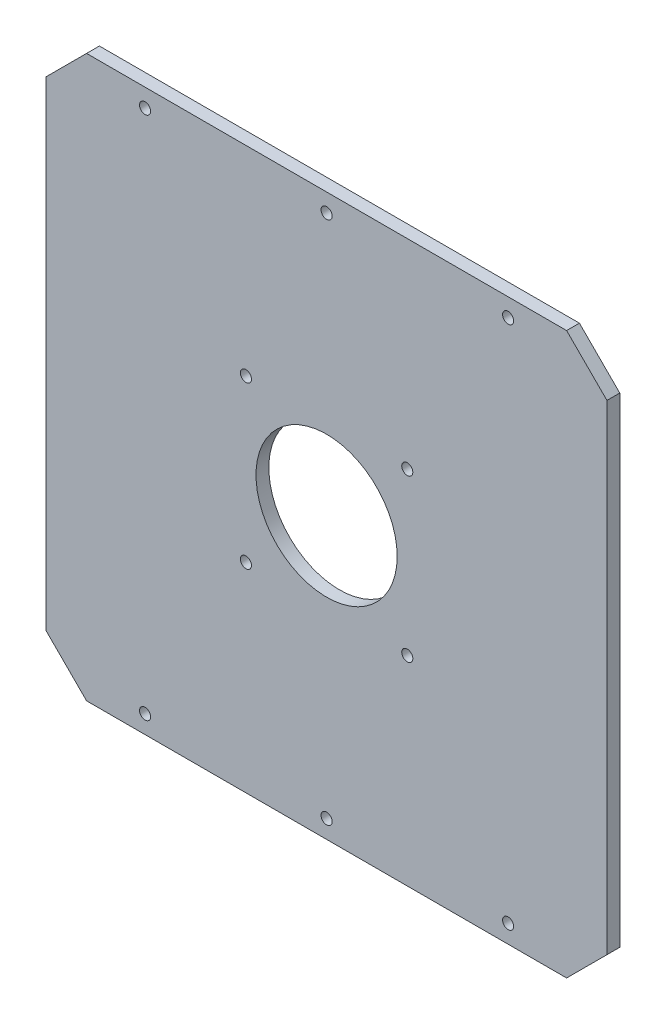
ISO-10303-21;
HEADER;
FILE_DESCRIPTION(('STEP AP214'),'2;1');
FILE_NAME('part.step','',(''),(''),'','','');
FILE_SCHEMA(('AUTOMOTIVE_DESIGN { 1 0 10303 214 1 1 1 1 }'));
ENDSEC;
DATA;
#1=APPLICATION_CONTEXT('core data for automotive mechanical design processes');
#2=APPLICATION_PROTOCOL_DEFINITION('international standard','automotive_design',2000,#1);
#3=PRODUCT_CONTEXT('',#1,'mechanical');
#4=PRODUCT('Part','Part','',(#3));
#5=PRODUCT_RELATED_PRODUCT_CATEGORY('part','',(#4));
#6=PRODUCT_DEFINITION_FORMATION('','',#4);
#7=PRODUCT_DEFINITION_CONTEXT('part definition',#1,'design');
#8=PRODUCT_DEFINITION('design','',#6,#7);
#9=PRODUCT_DEFINITION_SHAPE('','',#8);
#10=(LENGTH_UNIT() NAMED_UNIT(*) SI_UNIT(.MILLI.,.METRE.));
#11=(NAMED_UNIT(*) PLANE_ANGLE_UNIT() SI_UNIT($,.RADIAN.));
#12=(NAMED_UNIT(*) SI_UNIT($,.STERADIAN.) SOLID_ANGLE_UNIT());
#13=UNCERTAINTY_MEASURE_WITH_UNIT(LENGTH_MEASURE(1.E-05),#10,'distance_accuracy_value','');
#14=(GEOMETRIC_REPRESENTATION_CONTEXT(3) GLOBAL_UNCERTAINTY_ASSIGNED_CONTEXT((#13)) GLOBAL_UNIT_ASSIGNED_CONTEXT((#10,
#11,#12)) REPRESENTATION_CONTEXT('',''));
#15=CARTESIAN_POINT('',(0.,0.,0.));
#16=DIRECTION('',(0.,0.,1.));
#17=DIRECTION('',(1.,0.,0.));
#18=AXIS2_PLACEMENT_3D('',#15,#16,#17);
#19=CARTESIAN_POINT('',(-139.,-139.,6.35));
#20=DIRECTION('',(1.,0.,0.));
#21=DIRECTION('',(0.,0.,-1.));
#22=AXIS2_PLACEMENT_3D('',#19,#20,#21);
#23=PLANE('',#22);
#24=DIRECTION('',(0.,-1.,0.));
#25=VECTOR('',#24,1.);
#26=CARTESIAN_POINT('',(-139.,-139.,6.35));
#27=LINE('',#26,#25);
#28=CARTESIAN_POINT('',(-139.,119.,6.35));
#29=VERTEX_POINT('',#28);
#30=CARTESIAN_POINT('',(-139.,-119.,6.35));
#31=VERTEX_POINT('',#30);
#32=EDGE_CURVE('E130',#29,#31,#27,.T.);
#33=ORIENTED_EDGE('',*,*,#32,.F.);
#34=DIRECTION('',(0.,0.,-1.));
#35=VECTOR('',#34,1.);
#36=CARTESIAN_POINT('',(-139.,119.,6.35));
#37=LINE('',#36,#35);
#38=CARTESIAN_POINT('',(-139.,119.,0.));
#39=VERTEX_POINT('',#38);
#40=EDGE_CURVE('E11',#29,#39,#37,.T.);
#41=ORIENTED_EDGE('',*,*,#40,.T.);
#42=DIRECTION('',(0.,-1.,0.));
#43=VECTOR('',#42,1.);
#44=CARTESIAN_POINT('',(-139.,-139.,0.));
#45=LINE('',#44,#43);
#46=CARTESIAN_POINT('',(-139.,-119.,0.));
#47=VERTEX_POINT('',#46);
#48=EDGE_CURVE('E132',#39,#47,#45,.T.);
#49=ORIENTED_EDGE('',*,*,#48,.T.);
#50=DIRECTION('',(0.,0.,1.));
#51=VECTOR('',#50,1.);
#52=CARTESIAN_POINT('',(-139.,-119.,6.35));
#53=LINE('',#52,#51);
#54=EDGE_CURVE('E42',#47,#31,#53,.T.);
#55=ORIENTED_EDGE('',*,*,#54,.T.);
#56=EDGE_LOOP('',(#33,#41,#49,#55));
#57=FACE_BOUND('',#56,.T.);
#58=ADVANCED_FACE('F33',(#57),#23,.F.);
#59=CARTESIAN_POINT('',(139.,-139.,6.35));
#60=DIRECTION('',(0.,1.,0.));
#61=DIRECTION('',(0.,0.,1.));
#62=AXIS2_PLACEMENT_3D('',#59,#60,#61);
#63=PLANE('',#62);
#64=DIRECTION('',(1.,0.,0.));
#65=VECTOR('',#64,1.);
#66=CARTESIAN_POINT('',(139.,-139.,0.));
#67=LINE('',#66,#65);
#68=CARTESIAN_POINT('',(-119.,-139.,0.));
#69=VERTEX_POINT('',#68);
#70=CARTESIAN_POINT('',(119.,-139.,0.));
#71=VERTEX_POINT('',#70);
#72=EDGE_CURVE('E128',#69,#71,#67,.T.);
#73=ORIENTED_EDGE('',*,*,#72,.T.);
#74=DIRECTION('',(0.,0.,1.));
#75=VECTOR('',#74,1.);
#76=CARTESIAN_POINT('',(119.,-139.,6.35));
#77=LINE('',#76,#75);
#78=CARTESIAN_POINT('',(119.,-139.,6.35));
#79=VERTEX_POINT('',#78);
#80=EDGE_CURVE('E107',#71,#79,#77,.T.);
#81=ORIENTED_EDGE('',*,*,#80,.T.);
#82=DIRECTION('',(1.,0.,0.));
#83=VECTOR('',#82,1.);
#84=CARTESIAN_POINT('',(139.,-139.,6.35));
#85=LINE('',#84,#83);
#86=CARTESIAN_POINT('',(-119.,-139.,6.35));
#87=VERTEX_POINT('',#86);
#88=EDGE_CURVE('E225',#87,#79,#85,.T.);
#89=ORIENTED_EDGE('',*,*,#88,.F.);
#90=DIRECTION('',(0.,0.,-1.));
#91=VECTOR('',#90,1.);
#92=CARTESIAN_POINT('',(-119.,-139.,6.35));
#93=LINE('',#92,#91);
#94=EDGE_CURVE('E112',#87,#69,#93,.T.);
#95=ORIENTED_EDGE('',*,*,#94,.T.);
#96=EDGE_LOOP('',(#73,#81,#89,#95));
#97=FACE_BOUND('',#96,.T.);
#98=ADVANCED_FACE('F241',(#97),#63,.F.);
#99=CARTESIAN_POINT('',(139.,-139.,6.35));
#100=DIRECTION('',(-1.,0.,0.));
#101=DIRECTION('',(0.,0.,1.));
#102=AXIS2_PLACEMENT_3D('',#99,#100,#101);
#103=PLANE('',#102);
#104=DIRECTION('',(0.,1.,0.));
#105=VECTOR('',#104,1.);
#106=CARTESIAN_POINT('',(139.,-139.,6.35));
#107=LINE('',#106,#105);
#108=CARTESIAN_POINT('',(139.,-119.,6.35));
#109=VERTEX_POINT('',#108);
#110=CARTESIAN_POINT('',(139.,119.,6.35));
#111=VERTEX_POINT('',#110);
#112=EDGE_CURVE('E121',#109,#111,#107,.T.);
#113=ORIENTED_EDGE('',*,*,#112,.F.);
#114=DIRECTION('',(0.,0.,-1.));
#115=VECTOR('',#114,1.);
#116=CARTESIAN_POINT('',(139.,-119.,6.35));
#117=LINE('',#116,#115);
#118=CARTESIAN_POINT('',(139.,-119.,0.));
#119=VERTEX_POINT('',#118);
#120=EDGE_CURVE('E106',#109,#119,#117,.T.);
#121=ORIENTED_EDGE('',*,*,#120,.T.);
#122=DIRECTION('',(0.,1.,0.));
#123=VECTOR('',#122,1.);
#124=CARTESIAN_POINT('',(139.,-139.,0.));
#125=LINE('',#124,#123);
#126=CARTESIAN_POINT('',(139.,119.,0.));
#127=VERTEX_POINT('',#126);
#128=EDGE_CURVE('E119',#119,#127,#125,.T.);
#129=ORIENTED_EDGE('',*,*,#128,.T.);
#130=DIRECTION('',(0.,0.,1.));
#131=VECTOR('',#130,1.);
#132=CARTESIAN_POINT('',(139.,119.,6.35));
#133=LINE('',#132,#131);
#134=EDGE_CURVE('E123',#127,#111,#133,.T.);
#135=ORIENTED_EDGE('',*,*,#134,.T.);
#136=EDGE_LOOP('',(#113,#121,#129,#135));
#137=FACE_BOUND('',#136,.T.);
#138=ADVANCED_FACE('F118',(#137),#103,.F.);
#139=CARTESIAN_POINT('',(139.,139.,6.35));
#140=DIRECTION('',(0.,-1.,0.));
#141=DIRECTION('',(0.,0.,-1.));
#142=AXIS2_PLACEMENT_3D('',#139,#140,#141);
#143=PLANE('',#142);
#144=DIRECTION('',(-1.,0.,0.));
#145=VECTOR('',#144,1.);
#146=CARTESIAN_POINT('',(139.,139.,6.35));
#147=LINE('',#146,#145);
#148=CARTESIAN_POINT('',(119.,139.,6.35));
#149=VERTEX_POINT('',#148);
#150=CARTESIAN_POINT('',(-119.,139.,6.35));
#151=VERTEX_POINT('',#150);
#152=EDGE_CURVE('E136',#149,#151,#147,.T.);
#153=ORIENTED_EDGE('',*,*,#152,.F.);
#154=DIRECTION('',(0.,0.,-1.));
#155=VECTOR('',#154,1.);
#156=CARTESIAN_POINT('',(119.,139.,6.35));
#157=LINE('',#156,#155);
#158=CARTESIAN_POINT('',(119.,139.,0.));
#159=VERTEX_POINT('',#158);
#160=EDGE_CURVE('E153',#149,#159,#157,.T.);
#161=ORIENTED_EDGE('',*,*,#160,.T.);
#162=DIRECTION('',(-1.,0.,0.));
#163=VECTOR('',#162,1.);
#164=CARTESIAN_POINT('',(139.,139.,0.));
#165=LINE('',#164,#163);
#166=CARTESIAN_POINT('',(-119.,139.,0.));
#167=VERTEX_POINT('',#166);
#168=EDGE_CURVE('E127',#159,#167,#165,.T.);
#169=ORIENTED_EDGE('',*,*,#168,.T.);
#170=DIRECTION('',(0.,0.,1.));
#171=VECTOR('',#170,1.);
#172=CARTESIAN_POINT('',(-119.,139.,6.35));
#173=LINE('',#172,#171);
#174=EDGE_CURVE('E50',#167,#151,#173,.T.);
#175=ORIENTED_EDGE('',*,*,#174,.T.);
#176=EDGE_LOOP('',(#153,#161,#169,#175));
#177=FACE_BOUND('',#176,.T.);
#178=ADVANCED_FACE('F248',(#177),#143,.F.);
#179=CARTESIAN_POINT('',(0.,0.,6.35));
#180=DIRECTION('',(0.,0.,1.));
#181=DIRECTION('',(1.,0.,0.));
#182=AXIS2_PLACEMENT_3D('',#179,#180,#181);
#183=PLANE('',#182);
#184=CARTESIAN_POINT('',(-90.,-130.,6.35));
#185=DIRECTION('',(0.,0.,1.));
#186=DIRECTION('',(-1.,0.,0.));
#187=AXIS2_PLACEMENT_3D('',#184,#185,#186);
#188=CIRCLE('',#187,2.75000000000001);
#189=CARTESIAN_POINT('',(-92.75,-130.,6.35));
#190=VERTEX_POINT('',#189);
#191=EDGE_CURVE('E185',#190,#190,#188,.T.);
#192=ORIENTED_EDGE('',*,*,#191,.F.);
#193=EDGE_LOOP('',(#192));
#194=FACE_BOUND('',#193,.T.);
#195=CARTESIAN_POINT('',(0.,-130.,6.35));
#196=DIRECTION('',(0.,0.,1.));
#197=DIRECTION('',(-1.,0.,0.));
#198=AXIS2_PLACEMENT_3D('',#195,#196,#197);
#199=CIRCLE('',#198,2.75);
#200=CARTESIAN_POINT('',(-2.74999999999996,-130.,6.35));
#201=VERTEX_POINT('',#200);
#202=EDGE_CURVE('E175',#201,#201,#199,.T.);
#203=ORIENTED_EDGE('',*,*,#202,.F.);
#204=EDGE_LOOP('',(#203));
#205=FACE_BOUND('',#204,.T.);
#206=CARTESIAN_POINT('',(90.0000000000001,-130.,6.35));
#207=DIRECTION('',(0.,0.,1.));
#208=DIRECTION('',(1.,0.,0.));
#209=AXIS2_PLACEMENT_3D('',#206,#207,#208);
#210=CIRCLE('',#209,2.75000000000001);
#211=CARTESIAN_POINT('',(92.7500000000001,-130.,6.35));
#212=VERTEX_POINT('',#211);
#213=EDGE_CURVE('E172',#212,#212,#210,.T.);
#214=ORIENTED_EDGE('',*,*,#213,.F.);
#215=EDGE_LOOP('',(#214));
#216=FACE_BOUND('',#215,.T.);
#217=CARTESIAN_POINT('',(90.,130.,6.35));
#218=DIRECTION('',(0.,0.,1.));
#219=DIRECTION('',(-1.,0.,0.));
#220=AXIS2_PLACEMENT_3D('',#217,#218,#219);
#221=CIRCLE('',#220,2.75000000000001);
#222=CARTESIAN_POINT('',(87.25,130.,6.35));
#223=VERTEX_POINT('',#222);
#224=EDGE_CURVE('E169',#223,#223,#221,.T.);
#225=ORIENTED_EDGE('',*,*,#224,.F.);
#226=EDGE_LOOP('',(#225));
#227=FACE_BOUND('',#226,.T.);
#228=CARTESIAN_POINT('',(0.,130.,6.35));
#229=DIRECTION('',(0.,0.,1.));
#230=DIRECTION('',(1.,0.,0.));
#231=AXIS2_PLACEMENT_3D('',#228,#229,#230);
#232=CIRCLE('',#231,2.75);
#233=CARTESIAN_POINT('',(2.75000000000002,130.,6.35));
#234=VERTEX_POINT('',#233);
#235=EDGE_CURVE('E165',#234,#234,#232,.T.);
#236=ORIENTED_EDGE('',*,*,#235,.F.);
#237=EDGE_LOOP('',(#236));
#238=FACE_BOUND('',#237,.T.);
#239=CARTESIAN_POINT('',(-90.,130.,6.35));
#240=DIRECTION('',(0.,0.,1.));
#241=DIRECTION('',(1.,0.,0.));
#242=AXIS2_PLACEMENT_3D('',#239,#240,#241);
#243=CIRCLE('',#242,2.75000000000001);
#244=CARTESIAN_POINT('',(-87.25,130.,6.35));
#245=VERTEX_POINT('',#244);
#246=EDGE_CURVE('E161',#245,#245,#243,.T.);
#247=ORIENTED_EDGE('',*,*,#246,.F.);
#248=EDGE_LOOP('',(#247));
#249=FACE_BOUND('',#248,.T.);
#250=CARTESIAN_POINT('',(-40.,-40.,6.35));
#251=DIRECTION('',(0.,0.,1.));
#252=DIRECTION('',(-1.,0.,0.));
#253=AXIS2_PLACEMENT_3D('',#250,#251,#252);
#254=CIRCLE('',#253,2.75);
#255=CARTESIAN_POINT('',(-42.75,-40.,6.35));
#256=VERTEX_POINT('',#255);
#257=EDGE_CURVE('E160',#256,#256,#254,.T.);
#258=ORIENTED_EDGE('',*,*,#257,.F.);
#259=EDGE_LOOP('',(#258));
#260=FACE_BOUND('',#259,.T.);
#261=CARTESIAN_POINT('',(40.,-40.,6.35));
#262=DIRECTION('',(0.,0.,1.));
#263=DIRECTION('',(1.,0.,0.));
#264=AXIS2_PLACEMENT_3D('',#261,#262,#263);
#265=CIRCLE('',#264,2.75);
#266=CARTESIAN_POINT('',(42.75,-40.,6.35));
#267=VERTEX_POINT('',#266);
#268=EDGE_CURVE('E197',#267,#267,#265,.T.);
#269=ORIENTED_EDGE('',*,*,#268,.F.);
#270=EDGE_LOOP('',(#269));
#271=FACE_BOUND('',#270,.T.);
#272=CARTESIAN_POINT('',(40.,40.,6.35));
#273=DIRECTION('',(0.,0.,1.));
#274=DIRECTION('',(-1.,0.,0.));
#275=AXIS2_PLACEMENT_3D('',#272,#273,#274);
#276=CIRCLE('',#275,2.75);
#277=CARTESIAN_POINT('',(37.25,40.,6.35));
#278=VERTEX_POINT('',#277);
#279=EDGE_CURVE('E203',#278,#278,#276,.T.);
#280=ORIENTED_EDGE('',*,*,#279,.F.);
#281=EDGE_LOOP('',(#280));
#282=FACE_BOUND('',#281,.T.);
#283=CARTESIAN_POINT('',(-40.,40.,6.35));
#284=DIRECTION('',(0.,0.,1.));
#285=DIRECTION('',(1.,0.,0.));
#286=AXIS2_PLACEMENT_3D('',#283,#284,#285);
#287=CIRCLE('',#286,2.75);
#288=CARTESIAN_POINT('',(-37.25,40.,6.35));
#289=VERTEX_POINT('',#288);
#290=EDGE_CURVE('E209',#289,#289,#287,.T.);
#291=ORIENTED_EDGE('',*,*,#290,.F.);
#292=EDGE_LOOP('',(#291));
#293=FACE_BOUND('',#292,.T.);
#294=CARTESIAN_POINT('',(0.,0.,6.35));
#295=DIRECTION('',(0.,0.,1.));
#296=DIRECTION('',(1.,0.,0.));
#297=AXIS2_PLACEMENT_3D('',#294,#295,#296);
#298=CIRCLE('',#297,35.);
#299=CARTESIAN_POINT('',(35.,0.,6.35));
#300=VERTEX_POINT('',#299);
#301=EDGE_CURVE('E215',#300,#300,#298,.T.);
#302=ORIENTED_EDGE('',*,*,#301,.F.);
#303=EDGE_LOOP('',(#302));
#304=FACE_BOUND('',#303,.T.);
#305=ORIENTED_EDGE('',*,*,#88,.T.);
#306=DIRECTION('',(-0.70710678118655,-0.707106781186546,0.));
#307=VECTOR('',#306,1.);
#308=CARTESIAN_POINT('',(129.,-129.,6.35));
#309=LINE('',#308,#307);
#310=EDGE_CURVE('E150',#79,#109,#309,.F.);
#311=ORIENTED_EDGE('',*,*,#310,.T.);
#312=ORIENTED_EDGE('',*,*,#112,.T.);
#313=DIRECTION('',(0.707106781186546,-0.70710678118655,0.));
#314=VECTOR('',#313,1.);
#315=CARTESIAN_POINT('',(129.,129.,6.35));
#316=LINE('',#315,#314);
#317=EDGE_CURVE('E57',#111,#149,#316,.F.);
#318=ORIENTED_EDGE('',*,*,#317,.T.);
#319=ORIENTED_EDGE('',*,*,#152,.T.);
#320=DIRECTION('',(0.70710678118655,0.707106781186546,0.));
#321=VECTOR('',#320,1.);
#322=CARTESIAN_POINT('',(-129.,129.,6.35));
#323=LINE('',#322,#321);
#324=EDGE_CURVE('E147',#151,#29,#323,.F.);
#325=ORIENTED_EDGE('',*,*,#324,.T.);
#326=ORIENTED_EDGE('',*,*,#32,.T.);
#327=DIRECTION('',(-0.707106781186546,0.70710678118655,0.));
#328=VECTOR('',#327,1.);
#329=CARTESIAN_POINT('',(-129.,-129.,6.35));
#330=LINE('',#329,#328);
#331=EDGE_CURVE('E145',#31,#87,#330,.F.);
#332=ORIENTED_EDGE('',*,*,#331,.T.);
#333=EDGE_LOOP('',(#305,#311,#312,#318,#319,#325,#326,#332));
#334=FACE_BOUND('',#333,.T.);
#335=ADVANCED_FACE('F239',(#194,#205,#216,#227,#238,#249,#260,#271,#282,#293,#304,#334),#183,.T.);
#336=CARTESIAN_POINT('',(0.,0.,0.));
#337=DIRECTION('',(0.,0.,1.));
#338=DIRECTION('',(1.,0.,0.));
#339=AXIS2_PLACEMENT_3D('',#336,#337,#338);
#340=PLANE('',#339);
#341=CARTESIAN_POINT('',(-90.,-130.,0.));
#342=DIRECTION('',(0.,0.,1.));
#343=DIRECTION('',(1.,0.,0.));
#344=AXIS2_PLACEMENT_3D('',#341,#342,#343);
#345=CIRCLE('',#344,2.75000000000001);
#346=CARTESIAN_POINT('',(-87.25,-130.,0.));
#347=VERTEX_POINT('',#346);
#348=EDGE_CURVE('E37',#347,#347,#345,.T.);
#349=ORIENTED_EDGE('',*,*,#348,.T.);
#350=EDGE_LOOP('',(#349));
#351=FACE_BOUND('',#350,.T.);
#352=CARTESIAN_POINT('',(0.,-130.,0.));
#353=DIRECTION('',(0.,0.,1.));
#354=DIRECTION('',(1.,0.,0.));
#355=AXIS2_PLACEMENT_3D('',#352,#353,#354);
#356=CIRCLE('',#355,2.75);
#357=CARTESIAN_POINT('',(2.75000000000005,-130.,0.));
#358=VERTEX_POINT('',#357);
#359=EDGE_CURVE('E173',#358,#358,#356,.T.);
#360=ORIENTED_EDGE('',*,*,#359,.T.);
#361=EDGE_LOOP('',(#360));
#362=FACE_BOUND('',#361,.T.);
#363=CARTESIAN_POINT('',(90.0000000000001,-130.,0.));
#364=DIRECTION('',(0.,0.,1.));
#365=DIRECTION('',(1.,0.,0.));
#366=AXIS2_PLACEMENT_3D('',#363,#364,#365);
#367=CIRCLE('',#366,2.75000000000001);
#368=CARTESIAN_POINT('',(92.7500000000001,-130.,0.));
#369=VERTEX_POINT('',#368);
#370=EDGE_CURVE('E170',#369,#369,#367,.T.);
#371=ORIENTED_EDGE('',*,*,#370,.T.);
#372=EDGE_LOOP('',(#371));
#373=FACE_BOUND('',#372,.T.);
#374=CARTESIAN_POINT('',(90.,130.,0.));
#375=DIRECTION('',(0.,0.,1.));
#376=DIRECTION('',(1.,0.,0.));
#377=AXIS2_PLACEMENT_3D('',#374,#375,#376);
#378=CIRCLE('',#377,2.75000000000001);
#379=CARTESIAN_POINT('',(92.75,130.,0.));
#380=VERTEX_POINT('',#379);
#381=EDGE_CURVE('E166',#380,#380,#378,.T.);
#382=ORIENTED_EDGE('',*,*,#381,.T.);
#383=EDGE_LOOP('',(#382));
#384=FACE_BOUND('',#383,.T.);
#385=CARTESIAN_POINT('',(0.,130.,0.));
#386=DIRECTION('',(0.,0.,1.));
#387=DIRECTION('',(1.,0.,0.));
#388=AXIS2_PLACEMENT_3D('',#385,#386,#387);
#389=CIRCLE('',#388,2.75);
#390=CARTESIAN_POINT('',(2.75000000000002,130.,0.));
#391=VERTEX_POINT('',#390);
#392=EDGE_CURVE('E162',#391,#391,#389,.T.);
#393=ORIENTED_EDGE('',*,*,#392,.T.);
#394=EDGE_LOOP('',(#393));
#395=FACE_BOUND('',#394,.T.);
#396=CARTESIAN_POINT('',(-90.,130.,0.));
#397=DIRECTION('',(0.,0.,1.));
#398=DIRECTION('',(1.,0.,0.));
#399=AXIS2_PLACEMENT_3D('',#396,#397,#398);
#400=CIRCLE('',#399,2.75000000000001);
#401=CARTESIAN_POINT('',(-87.25,130.,0.));
#402=VERTEX_POINT('',#401);
#403=EDGE_CURVE('E157',#402,#402,#400,.T.);
#404=ORIENTED_EDGE('',*,*,#403,.T.);
#405=EDGE_LOOP('',(#404));
#406=FACE_BOUND('',#405,.T.);
#407=CARTESIAN_POINT('',(-40.,-40.,0.));
#408=DIRECTION('',(0.,0.,1.));
#409=DIRECTION('',(-1.,0.,0.));
#410=AXIS2_PLACEMENT_3D('',#407,#408,#409);
#411=CIRCLE('',#410,2.75);
#412=CARTESIAN_POINT('',(-42.75,-40.,0.));
#413=VERTEX_POINT('',#412);
#414=EDGE_CURVE('E194',#413,#413,#411,.T.);
#415=ORIENTED_EDGE('',*,*,#414,.T.);
#416=EDGE_LOOP('',(#415));
#417=FACE_BOUND('',#416,.T.);
#418=CARTESIAN_POINT('',(40.,-40.,0.));
#419=DIRECTION('',(0.,0.,1.));
#420=DIRECTION('',(1.,0.,0.));
#421=AXIS2_PLACEMENT_3D('',#418,#419,#420);
#422=CIRCLE('',#421,2.75);
#423=CARTESIAN_POINT('',(42.75,-40.,0.));
#424=VERTEX_POINT('',#423);
#425=EDGE_CURVE('E200',#424,#424,#422,.T.);
#426=ORIENTED_EDGE('',*,*,#425,.T.);
#427=EDGE_LOOP('',(#426));
#428=FACE_BOUND('',#427,.T.);
#429=CARTESIAN_POINT('',(40.,40.,0.));
#430=DIRECTION('',(0.,0.,1.));
#431=DIRECTION('',(-1.,0.,0.));
#432=AXIS2_PLACEMENT_3D('',#429,#430,#431);
#433=CIRCLE('',#432,2.75);
#434=CARTESIAN_POINT('',(37.25,40.,0.));
#435=VERTEX_POINT('',#434);
#436=EDGE_CURVE('E206',#435,#435,#433,.T.);
#437=ORIENTED_EDGE('',*,*,#436,.T.);
#438=EDGE_LOOP('',(#437));
#439=FACE_BOUND('',#438,.T.);
#440=CARTESIAN_POINT('',(-40.,40.,0.));
#441=DIRECTION('',(0.,0.,1.));
#442=DIRECTION('',(1.,0.,0.));
#443=AXIS2_PLACEMENT_3D('',#440,#441,#442);
#444=CIRCLE('',#443,2.75);
#445=CARTESIAN_POINT('',(-37.25,40.,0.));
#446=VERTEX_POINT('',#445);
#447=EDGE_CURVE('E212',#446,#446,#444,.T.);
#448=ORIENTED_EDGE('',*,*,#447,.T.);
#449=EDGE_LOOP('',(#448));
#450=FACE_BOUND('',#449,.T.);
#451=CARTESIAN_POINT('',(0.,0.,0.));
#452=DIRECTION('',(0.,0.,1.));
#453=DIRECTION('',(1.,0.,0.));
#454=AXIS2_PLACEMENT_3D('',#451,#452,#453);
#455=CIRCLE('',#454,35.);
#456=CARTESIAN_POINT('',(35.,0.,0.));
#457=VERTEX_POINT('',#456);
#458=EDGE_CURVE('E218',#457,#457,#455,.T.);
#459=ORIENTED_EDGE('',*,*,#458,.T.);
#460=EDGE_LOOP('',(#459));
#461=FACE_BOUND('',#460,.T.);
#462=ORIENTED_EDGE('',*,*,#128,.F.);
#463=DIRECTION('',(0.70710678118655,0.707106781186546,0.));
#464=VECTOR('',#463,1.);
#465=CARTESIAN_POINT('',(139.,-119.,0.));
#466=LINE('',#465,#464);
#467=EDGE_CURVE('E102',#119,#71,#466,.F.);
#468=ORIENTED_EDGE('',*,*,#467,.T.);
#469=ORIENTED_EDGE('',*,*,#72,.F.);
#470=DIRECTION('',(0.707106781186546,-0.70710678118655,0.));
#471=VECTOR('',#470,1.);
#472=CARTESIAN_POINT('',(-119.,-139.,0.));
#473=LINE('',#472,#471);
#474=EDGE_CURVE('E122',#69,#47,#473,.F.);
#475=ORIENTED_EDGE('',*,*,#474,.T.);
#476=ORIENTED_EDGE('',*,*,#48,.F.);
#477=DIRECTION('',(-0.70710678118655,-0.707106781186546,0.));
#478=VECTOR('',#477,1.);
#479=CARTESIAN_POINT('',(-139.,119.,0.));
#480=LINE('',#479,#478);
#481=EDGE_CURVE('E139',#39,#167,#480,.F.);
#482=ORIENTED_EDGE('',*,*,#481,.T.);
#483=ORIENTED_EDGE('',*,*,#168,.F.);
#484=DIRECTION('',(-0.707106781186546,0.70710678118655,0.));
#485=VECTOR('',#484,1.);
#486=CARTESIAN_POINT('',(119.,139.,0.));
#487=LINE('',#486,#485);
#488=EDGE_CURVE('E113',#159,#127,#487,.F.);
#489=ORIENTED_EDGE('',*,*,#488,.T.);
#490=EDGE_LOOP('',(#462,#468,#469,#475,#476,#482,#483,#489));
#491=FACE_BOUND('',#490,.T.);
#492=ADVANCED_FACE('F125',(#351,#362,#373,#384,#395,#406,#417,#428,#439,#450,#461,#491),#340,.F.);
#493=CARTESIAN_POINT('',(0.,0.,0.));
#494=DIRECTION('',(0.,0.,1.));
#495=DIRECTION('',(1.,0.,0.));
#496=AXIS2_PLACEMENT_3D('',#493,#494,#495);
#497=CYLINDRICAL_SURFACE('',#496,35.);
#498=ORIENTED_EDGE('',*,*,#458,.F.);
#499=EDGE_LOOP('',(#498));
#500=FACE_BOUND('',#499,.T.);
#501=ORIENTED_EDGE('',*,*,#301,.T.);
#502=EDGE_LOOP('',(#501));
#503=FACE_BOUND('',#502,.T.);
#504=ADVANCED_FACE('F276',(#500,#503),#497,.F.);
#505=CARTESIAN_POINT('',(-40.,40.,0.));
#506=DIRECTION('',(0.,0.,1.));
#507=DIRECTION('',(1.,0.,0.));
#508=AXIS2_PLACEMENT_3D('',#505,#506,#507);
#509=CYLINDRICAL_SURFACE('',#508,2.75);
#510=ORIENTED_EDGE('',*,*,#447,.F.);
#511=EDGE_LOOP('',(#510));
#512=FACE_BOUND('',#511,.T.);
#513=ORIENTED_EDGE('',*,*,#290,.T.);
#514=EDGE_LOOP('',(#513));
#515=FACE_BOUND('',#514,.T.);
#516=ADVANCED_FACE('F281',(#512,#515),#509,.F.);
#517=CARTESIAN_POINT('',(40.,40.,0.));
#518=DIRECTION('',(0.,0.,1.));
#519=DIRECTION('',(1.,0.,0.));
#520=AXIS2_PLACEMENT_3D('',#517,#518,#519);
#521=CYLINDRICAL_SURFACE('',#520,2.75);
#522=ORIENTED_EDGE('',*,*,#436,.F.);
#523=EDGE_LOOP('',(#522));
#524=FACE_BOUND('',#523,.T.);
#525=ORIENTED_EDGE('',*,*,#279,.T.);
#526=EDGE_LOOP('',(#525));
#527=FACE_BOUND('',#526,.T.);
#528=ADVANCED_FACE('F285',(#524,#527),#521,.F.);
#529=CARTESIAN_POINT('',(40.,-40.,0.));
#530=DIRECTION('',(0.,0.,1.));
#531=DIRECTION('',(1.,0.,0.));
#532=AXIS2_PLACEMENT_3D('',#529,#530,#531);
#533=CYLINDRICAL_SURFACE('',#532,2.75);
#534=ORIENTED_EDGE('',*,*,#425,.F.);
#535=EDGE_LOOP('',(#534));
#536=FACE_BOUND('',#535,.T.);
#537=ORIENTED_EDGE('',*,*,#268,.T.);
#538=EDGE_LOOP('',(#537));
#539=FACE_BOUND('',#538,.T.);
#540=ADVANCED_FACE('F289',(#536,#539),#533,.F.);
#541=CARTESIAN_POINT('',(-40.,-40.,0.));
#542=DIRECTION('',(0.,0.,1.));
#543=DIRECTION('',(1.,0.,0.));
#544=AXIS2_PLACEMENT_3D('',#541,#542,#543);
#545=CYLINDRICAL_SURFACE('',#544,2.75);
#546=ORIENTED_EDGE('',*,*,#414,.F.);
#547=EDGE_LOOP('',(#546));
#548=FACE_BOUND('',#547,.T.);
#549=ORIENTED_EDGE('',*,*,#257,.T.);
#550=EDGE_LOOP('',(#549));
#551=FACE_BOUND('',#550,.T.);
#552=ADVANCED_FACE('F256',(#548,#551),#545,.F.);
#553=CARTESIAN_POINT('',(139.,-119.,6.35));
#554=DIRECTION('',(-0.707106781186545,0.707106781186549,0.));
#555=DIRECTION('',(0.,0.,-1.));
#556=AXIS2_PLACEMENT_3D('',#553,#554,#555);
#557=PLANE('',#556);
#558=ORIENTED_EDGE('',*,*,#310,.F.);
#559=ORIENTED_EDGE('',*,*,#80,.F.);
#560=ORIENTED_EDGE('',*,*,#467,.F.);
#561=ORIENTED_EDGE('',*,*,#120,.F.);
#562=EDGE_LOOP('',(#558,#559,#560,#561));
#563=FACE_BOUND('',#562,.T.);
#564=ADVANCED_FACE('F105',(#563),#557,.F.);
#565=CARTESIAN_POINT('',(119.,139.,6.35));
#566=DIRECTION('',(-0.707106781186549,-0.707106781186545,0.));
#567=DIRECTION('',(0.,0.,-1.));
#568=AXIS2_PLACEMENT_3D('',#565,#566,#567);
#569=PLANE('',#568);
#570=ORIENTED_EDGE('',*,*,#317,.F.);
#571=ORIENTED_EDGE('',*,*,#134,.F.);
#572=ORIENTED_EDGE('',*,*,#488,.F.);
#573=ORIENTED_EDGE('',*,*,#160,.F.);
#574=EDGE_LOOP('',(#570,#571,#572,#573));
#575=FACE_BOUND('',#574,.T.);
#576=ADVANCED_FACE('F255',(#575),#569,.F.);
#577=CARTESIAN_POINT('',(-139.,119.,6.35));
#578=DIRECTION('',(0.707106781186545,-0.707106781186549,0.));
#579=DIRECTION('',(0.,0.,-1.));
#580=AXIS2_PLACEMENT_3D('',#577,#578,#579);
#581=PLANE('',#580);
#582=ORIENTED_EDGE('',*,*,#324,.F.);
#583=ORIENTED_EDGE('',*,*,#174,.F.);
#584=ORIENTED_EDGE('',*,*,#481,.F.);
#585=ORIENTED_EDGE('',*,*,#40,.F.);
#586=EDGE_LOOP('',(#582,#583,#584,#585));
#587=FACE_BOUND('',#586,.T.);
#588=ADVANCED_FACE('F258',(#587),#581,.F.);
#589=CARTESIAN_POINT('',(-119.,-139.,6.35));
#590=DIRECTION('',(0.707106781186549,0.707106781186545,0.));
#591=DIRECTION('',(0.,0.,-1.));
#592=AXIS2_PLACEMENT_3D('',#589,#590,#591);
#593=PLANE('',#592);
#594=ORIENTED_EDGE('',*,*,#331,.F.);
#595=ORIENTED_EDGE('',*,*,#54,.F.);
#596=ORIENTED_EDGE('',*,*,#474,.F.);
#597=ORIENTED_EDGE('',*,*,#94,.F.);
#598=EDGE_LOOP('',(#594,#595,#596,#597));
#599=FACE_BOUND('',#598,.T.);
#600=ADVANCED_FACE('F35',(#599),#593,.F.);
#601=CARTESIAN_POINT('',(-90.,130.,-69.85));
#602=DIRECTION('',(0.,0.,1.));
#603=DIRECTION('',(1.,0.,0.));
#604=AXIS2_PLACEMENT_3D('',#601,#602,#603);
#605=CYLINDRICAL_SURFACE('',#604,2.75000000000001);
#606=ORIENTED_EDGE('',*,*,#246,.T.);
#607=EDGE_LOOP('',(#606));
#608=FACE_BOUND('',#607,.T.);
#609=ORIENTED_EDGE('',*,*,#403,.F.);
#610=EDGE_LOOP('',(#609));
#611=FACE_BOUND('',#610,.T.);
#612=ADVANCED_FACE('F265',(#608,#611),#605,.F.);
#613=CARTESIAN_POINT('',(0.,130.,-69.85));
#614=DIRECTION('',(0.,0.,1.));
#615=DIRECTION('',(1.,0.,0.));
#616=AXIS2_PLACEMENT_3D('',#613,#614,#615);
#617=CYLINDRICAL_SURFACE('',#616,2.75);
#618=ORIENTED_EDGE('',*,*,#235,.T.);
#619=EDGE_LOOP('',(#618));
#620=FACE_BOUND('',#619,.T.);
#621=ORIENTED_EDGE('',*,*,#392,.F.);
#622=EDGE_LOOP('',(#621));
#623=FACE_BOUND('',#622,.T.);
#624=ADVANCED_FACE('F299',(#620,#623),#617,.F.);
#625=CARTESIAN_POINT('',(90.,130.,-69.85));
#626=DIRECTION('',(0.,0.,1.));
#627=DIRECTION('',(1.,0.,0.));
#628=AXIS2_PLACEMENT_3D('',#625,#626,#627);
#629=CYLINDRICAL_SURFACE('',#628,2.75000000000001);
#630=ORIENTED_EDGE('',*,*,#224,.T.);
#631=EDGE_LOOP('',(#630));
#632=FACE_BOUND('',#631,.T.);
#633=ORIENTED_EDGE('',*,*,#381,.F.);
#634=EDGE_LOOP('',(#633));
#635=FACE_BOUND('',#634,.T.);
#636=ADVANCED_FACE('F303',(#632,#635),#629,.F.);
#637=CARTESIAN_POINT('',(90.0000000000001,-130.,-69.85));
#638=DIRECTION('',(0.,0.,1.));
#639=DIRECTION('',(1.,0.,0.));
#640=AXIS2_PLACEMENT_3D('',#637,#638,#639);
#641=CYLINDRICAL_SURFACE('',#640,2.75000000000001);
#642=ORIENTED_EDGE('',*,*,#213,.T.);
#643=EDGE_LOOP('',(#642));
#644=FACE_BOUND('',#643,.T.);
#645=ORIENTED_EDGE('',*,*,#370,.F.);
#646=EDGE_LOOP('',(#645));
#647=FACE_BOUND('',#646,.T.);
#648=ADVANCED_FACE('F307',(#644,#647),#641,.F.);
#649=CARTESIAN_POINT('',(0.,-130.,-69.85));
#650=DIRECTION('',(0.,0.,1.));
#651=DIRECTION('',(1.,0.,0.));
#652=AXIS2_PLACEMENT_3D('',#649,#650,#651);
#653=CYLINDRICAL_SURFACE('',#652,2.75);
#654=ORIENTED_EDGE('',*,*,#202,.T.);
#655=EDGE_LOOP('',(#654));
#656=FACE_BOUND('',#655,.T.);
#657=ORIENTED_EDGE('',*,*,#359,.F.);
#658=EDGE_LOOP('',(#657));
#659=FACE_BOUND('',#658,.T.);
#660=ADVANCED_FACE('F311',(#656,#659),#653,.F.);
#661=CARTESIAN_POINT('',(-90.,-130.,-69.85));
#662=DIRECTION('',(0.,0.,1.));
#663=DIRECTION('',(1.,0.,0.));
#664=AXIS2_PLACEMENT_3D('',#661,#662,#663);
#665=CYLINDRICAL_SURFACE('',#664,2.75000000000001);
#666=ORIENTED_EDGE('',*,*,#191,.T.);
#667=EDGE_LOOP('',(#666));
#668=FACE_BOUND('',#667,.T.);
#669=ORIENTED_EDGE('',*,*,#348,.F.);
#670=EDGE_LOOP('',(#669));
#671=FACE_BOUND('',#670,.T.);
#672=ADVANCED_FACE('F315',(#668,#671),#665,.F.);
#673=CLOSED_SHELL('',(#58,#98,#138,#178,#335,#492,#504,#516,#528,#540,#552,#564,#576,#588,#600,
#612,#624,#636,#648,#660,#672));
#674=MANIFOLD_SOLID_BREP('B2',#673);
#675=ADVANCED_BREP_SHAPE_REPRESENTATION('',(#18,#674),#14);
#676=SHAPE_DEFINITION_REPRESENTATION(#9,#675);
ENDSEC;
END-ISO-10303-21;
